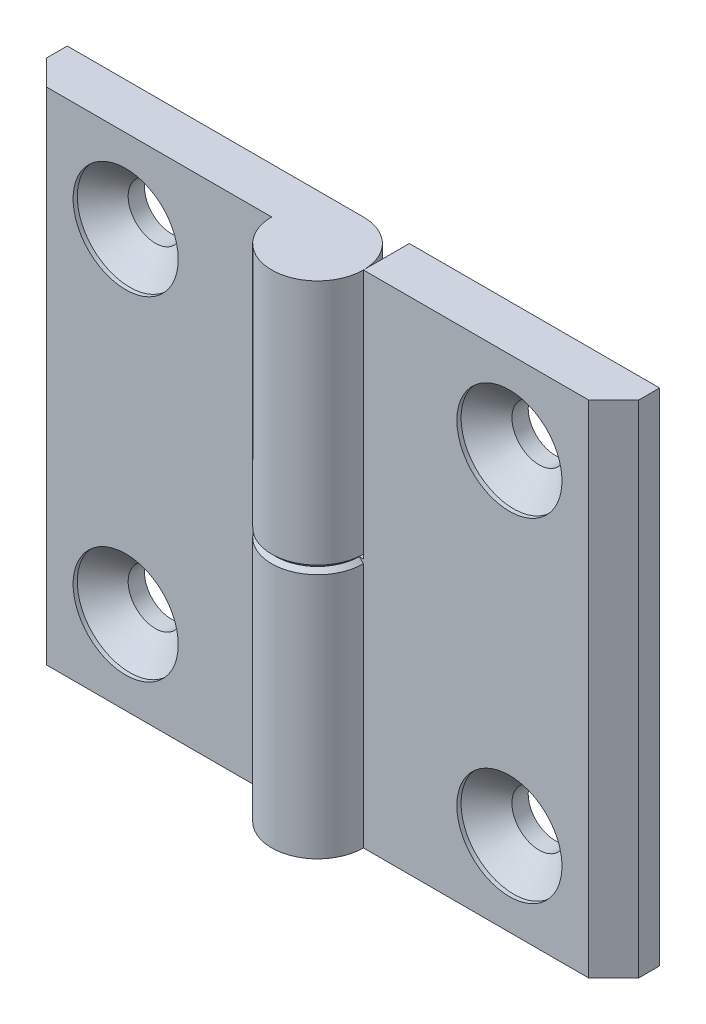
ISO-10303-21;
HEADER;
FILE_DESCRIPTION(('STEP AP214'),'2;1');
FILE_NAME('part.step','',(''),(''),'','','');
FILE_SCHEMA(('AUTOMOTIVE_DESIGN { 1 0 10303 214 1 1 1 1 }'));
ENDSEC;
DATA;
#1=APPLICATION_CONTEXT('core data for automotive mechanical design processes');
#2=APPLICATION_PROTOCOL_DEFINITION('international standard','automotive_design',2000,#1);
#3=PRODUCT_CONTEXT('',#1,'mechanical');
#4=PRODUCT('Part','Part','',(#3));
#5=PRODUCT_RELATED_PRODUCT_CATEGORY('part','',(#4));
#6=PRODUCT_DEFINITION_FORMATION('','',#4);
#7=PRODUCT_DEFINITION_CONTEXT('part definition',#1,'design');
#8=PRODUCT_DEFINITION('design','',#6,#7);
#9=PRODUCT_DEFINITION_SHAPE('','',#8);
#10=(LENGTH_UNIT() NAMED_UNIT(*) SI_UNIT(.MILLI.,.METRE.));
#11=(NAMED_UNIT(*) PLANE_ANGLE_UNIT() SI_UNIT($,.RADIAN.));
#12=(NAMED_UNIT(*) SI_UNIT($,.STERADIAN.) SOLID_ANGLE_UNIT());
#13=UNCERTAINTY_MEASURE_WITH_UNIT(LENGTH_MEASURE(1.E-05),#10,'distance_accuracy_value','');
#14=(GEOMETRIC_REPRESENTATION_CONTEXT(3) GLOBAL_UNCERTAINTY_ASSIGNED_CONTEXT((#13)) GLOBAL_UNIT_ASSIGNED_CONTEXT((#10,
#11,#12)) REPRESENTATION_CONTEXT('',''));
#15=CARTESIAN_POINT('',(0.,0.,0.));
#16=DIRECTION('',(0.,0.,1.));
#17=DIRECTION('',(1.,0.,0.));
#18=AXIS2_PLACEMENT_3D('',#15,#16,#17);
#19=CARTESIAN_POINT('',(0.,-30.,0.));
#20=DIRECTION('',(0.,1.,0.));
#21=DIRECTION('',(0.,0.,-1.));
#22=AXIS2_PLACEMENT_3D('',#19,#20,#21);
#23=CYLINDRICAL_SURFACE('',#22,5.5);
#24=DIRECTION('',(0.,1.,0.));
#25=VECTOR('',#24,1.);
#26=CARTESIAN_POINT('',(5.5,-30.,0.));
#27=LINE('',#26,#25);
#28=CARTESIAN_POINT('',(5.5,-30.,0.));
#29=VERTEX_POINT('',#28);
#30=CARTESIAN_POINT('',(5.5,-0.499999999999997,0.));
#31=VERTEX_POINT('',#30);
#32=EDGE_CURVE('E157',#29,#31,#27,.T.);
#33=ORIENTED_EDGE('',*,*,#32,.T.);
#34=CARTESIAN_POINT('',(0.,-0.499999999999997,0.));
#35=DIRECTION('',(0.,-1.,0.));
#36=DIRECTION('',(0.,0.,1.));
#37=AXIS2_PLACEMENT_3D('',#34,#35,#36);
#38=CIRCLE('',#37,5.5);
#39=CARTESIAN_POINT('',(0.,-0.499999999999997,-5.5));
#40=VERTEX_POINT('',#39);
#41=EDGE_CURVE('E175',#31,#40,#38,.T.);
#42=ORIENTED_EDGE('',*,*,#41,.T.);
#43=DIRECTION('',(0.,1.,0.));
#44=VECTOR('',#43,1.);
#45=CARTESIAN_POINT('',(0.,-30.,-5.5));
#46=LINE('',#45,#44);
#47=CARTESIAN_POINT('',(0.,-30.,-5.5));
#48=VERTEX_POINT('',#47);
#49=EDGE_CURVE('E167',#48,#40,#46,.T.);
#50=ORIENTED_EDGE('',*,*,#49,.F.);
#51=CARTESIAN_POINT('',(0.,-30.,0.));
#52=DIRECTION('',(0.,-1.,0.));
#53=DIRECTION('',(0.,0.,1.));
#54=AXIS2_PLACEMENT_3D('',#51,#52,#53);
#55=CIRCLE('',#54,5.5);
#56=EDGE_CURVE('E156',#29,#48,#55,.T.);
#57=ORIENTED_EDGE('',*,*,#56,.F.);
#58=EDGE_LOOP('',(#33,#42,#50,#57));
#59=FACE_BOUND('',#58,.T.);
#60=ADVANCED_FACE('F46',(#59),#23,.T.);
#61=CARTESIAN_POINT('',(0.,-30.,-5.5));
#62=DIRECTION('',(0.,0.,1.));
#63=DIRECTION('',(-1.,0.,0.));
#64=AXIS2_PLACEMENT_3D('',#61,#62,#63);
#65=PLANE('',#64);
#66=CARTESIAN_POINT('',(23.,-20.,-5.50000000000017));
#67=DIRECTION('',(0.,0.,1.));
#68=DIRECTION('',(-1.,0.,0.));
#69=AXIS2_PLACEMENT_3D('',#66,#67,#68);
#70=CIRCLE('',#69,3.25);
#71=CARTESIAN_POINT('',(19.75,-20.,-5.50000000000015));
#72=VERTEX_POINT('',#71);
#73=EDGE_CURVE('E197',#72,#72,#70,.T.);
#74=ORIENTED_EDGE('',*,*,#73,.T.);
#75=EDGE_LOOP('',(#74));
#76=FACE_BOUND('',#75,.T.);
#77=CARTESIAN_POINT('',(23.,20.,-5.50000000000017));
#78=DIRECTION('',(0.,0.,1.));
#79=DIRECTION('',(-1.,0.,0.));
#80=AXIS2_PLACEMENT_3D('',#77,#78,#79);
#81=CIRCLE('',#80,3.25);
#82=CARTESIAN_POINT('',(19.75,20.,-5.50000000000015));
#83=VERTEX_POINT('',#82);
#84=EDGE_CURVE('E139',#83,#83,#81,.T.);
#85=ORIENTED_EDGE('',*,*,#84,.T.);
#86=EDGE_LOOP('',(#85));
#87=FACE_BOUND('',#86,.T.);
#88=ORIENTED_EDGE('',*,*,#49,.T.);
#89=DIRECTION('',(1.,0.,0.));
#90=VECTOR('',#89,1.);
#91=CARTESIAN_POINT('',(0.,-0.499999999999997,-5.5));
#92=LINE('',#91,#90);
#93=CARTESIAN_POINT('',(5.49999999999996,-0.499999999999997,-5.50000000000004));
#94=VERTEX_POINT('',#93);
#95=EDGE_CURVE('E138',#40,#94,#92,.T.);
#96=ORIENTED_EDGE('',*,*,#95,.T.);
#97=DIRECTION('',(0.,1.,0.));
#98=VECTOR('',#97,1.);
#99=CARTESIAN_POINT('',(5.49999999999996,30.,-5.50000000000004));
#100=LINE('',#99,#98);
#101=CARTESIAN_POINT('',(5.49999999999996,30.,-5.50000000000004));
#102=VERTEX_POINT('',#101);
#103=EDGE_CURVE('E119',#94,#102,#100,.T.);
#104=ORIENTED_EDGE('',*,*,#103,.T.);
#105=DIRECTION('',(1.,0.,0.));
#106=VECTOR('',#105,1.);
#107=CARTESIAN_POINT('',(0.,30.,-5.5));
#108=LINE('',#107,#106);
#109=CARTESIAN_POINT('',(35.5,30.,-5.50000000000026));
#110=VERTEX_POINT('',#109);
#111=EDGE_CURVE('E135',#102,#110,#108,.T.);
#112=ORIENTED_EDGE('',*,*,#111,.T.);
#113=DIRECTION('',(0.,1.,0.));
#114=VECTOR('',#113,1.);
#115=CARTESIAN_POINT('',(35.5,-30.,-5.50000000000026));
#116=LINE('',#115,#114);
#117=CARTESIAN_POINT('',(35.5,-30.,-5.50000000000026));
#118=VERTEX_POINT('',#117);
#119=EDGE_CURVE('E165',#118,#110,#116,.T.);
#120=ORIENTED_EDGE('',*,*,#119,.F.);
#121=DIRECTION('',(1.,0.,0.));
#122=VECTOR('',#121,1.);
#123=CARTESIAN_POINT('',(0.,-30.,-5.5));
#124=LINE('',#123,#122);
#125=EDGE_CURVE('E213',#48,#118,#124,.T.);
#126=ORIENTED_EDGE('',*,*,#125,.F.);
#127=EDGE_LOOP('',(#88,#96,#104,#112,#120,#126));
#128=FACE_BOUND('',#127,.T.);
#129=ADVANCED_FACE('F133',(#76,#87,#128),#65,.F.);
#130=CARTESIAN_POINT('',(35.5,-30.,-5.50000000000026));
#131=DIRECTION('',(-1.,0.,0.));
#132=DIRECTION('',(0.,0.,-1.));
#133=AXIS2_PLACEMENT_3D('',#130,#131,#132);
#134=PLANE('',#133);
#135=DIRECTION('',(0.,0.,1.));
#136=VECTOR('',#135,1.);
#137=CARTESIAN_POINT('',(35.5,30.,-5.50000000000026));
#138=LINE('',#137,#136);
#139=CARTESIAN_POINT('',(35.5,30.,-3.00000000000026));
#140=VERTEX_POINT('',#139);
#141=EDGE_CURVE('E144',#110,#140,#138,.T.);
#142=ORIENTED_EDGE('',*,*,#141,.T.);
#143=DIRECTION('',(0.,1.,0.));
#144=VECTOR('',#143,1.);
#145=CARTESIAN_POINT('',(35.5,-30.,-3.00000000000026));
#146=LINE('',#145,#144);
#147=CARTESIAN_POINT('',(35.5,-30.,-3.00000000000026));
#148=VERTEX_POINT('',#147);
#149=EDGE_CURVE('E162',#148,#140,#146,.T.);
#150=ORIENTED_EDGE('',*,*,#149,.F.);
#151=DIRECTION('',(0.,0.,1.));
#152=VECTOR('',#151,1.);
#153=CARTESIAN_POINT('',(35.5,-30.,-5.50000000000026));
#154=LINE('',#153,#152);
#155=EDGE_CURVE('E215',#118,#148,#154,.T.);
#156=ORIENTED_EDGE('',*,*,#155,.F.);
#157=ORIENTED_EDGE('',*,*,#119,.T.);
#158=EDGE_LOOP('',(#142,#150,#156,#157));
#159=FACE_BOUND('',#158,.T.);
#160=ADVANCED_FACE('F229',(#159),#134,.F.);
#161=CARTESIAN_POINT('',(35.5,-30.,-3.00000000000026));
#162=DIRECTION('',(-0.707106781186549,0.,-0.707106781186546));
#163=DIRECTION('',(0.707106781186546,0.,-0.707106781186549));
#164=AXIS2_PLACEMENT_3D('',#161,#162,#163);
#165=PLANE('',#164);
#166=DIRECTION('',(-0.707106781186546,0.,0.707106781186549));
#167=VECTOR('',#166,1.);
#168=CARTESIAN_POINT('',(35.5,30.,-3.00000000000026));
#169=LINE('',#168,#167);
#170=CARTESIAN_POINT('',(32.5,30.,-2.42866695413719E-13));
#171=VERTEX_POINT('',#170);
#172=EDGE_CURVE('E146',#140,#171,#169,.T.);
#173=ORIENTED_EDGE('',*,*,#172,.T.);
#174=DIRECTION('',(0.,1.,0.));
#175=VECTOR('',#174,1.);
#176=CARTESIAN_POINT('',(32.5,-30.,-2.42866695413719E-13));
#177=LINE('',#176,#175);
#178=CARTESIAN_POINT('',(32.5,-30.,-2.42866695413719E-13));
#179=VERTEX_POINT('',#178);
#180=EDGE_CURVE('E159',#179,#171,#177,.T.);
#181=ORIENTED_EDGE('',*,*,#180,.F.);
#182=DIRECTION('',(-0.707106781186546,0.,0.707106781186549));
#183=VECTOR('',#182,1.);
#184=CARTESIAN_POINT('',(35.5,-30.,-3.00000000000026));
#185=LINE('',#184,#183);
#186=EDGE_CURVE('E216',#148,#179,#185,.T.);
#187=ORIENTED_EDGE('',*,*,#186,.F.);
#188=ORIENTED_EDGE('',*,*,#149,.T.);
#189=EDGE_LOOP('',(#173,#181,#187,#188));
#190=FACE_BOUND('',#189,.T.);
#191=ADVANCED_FACE('F231',(#190),#165,.F.);
#192=CARTESIAN_POINT('',(32.5,-30.,-2.42866695413719E-13));
#193=DIRECTION('',(0.,0.,-1.));
#194=DIRECTION('',(1.,0.,0.));
#195=AXIS2_PLACEMENT_3D('',#192,#193,#194);
#196=PLANE('',#195);
#197=CARTESIAN_POINT('',(23.,-20.,-1.72091732573437E-13));
#198=DIRECTION('',(0.,0.,1.));
#199=DIRECTION('',(-1.,0.,0.));
#200=AXIS2_PLACEMENT_3D('',#197,#198,#199);
#201=CIRCLE('',#200,6.3);
#202=CARTESIAN_POINT('',(16.7,-20.,-1.25012957770162E-13));
#203=VERTEX_POINT('',#202);
#204=EDGE_CURVE('E185',#203,#203,#201,.T.);
#205=ORIENTED_EDGE('',*,*,#204,.F.);
#206=EDGE_LOOP('',(#205));
#207=FACE_BOUND('',#206,.T.);
#208=CARTESIAN_POINT('',(23.,20.,-1.72091732573437E-13));
#209=DIRECTION('',(0.,0.,1.));
#210=DIRECTION('',(-1.,0.,0.));
#211=AXIS2_PLACEMENT_3D('',#208,#209,#210);
#212=CIRCLE('',#211,6.3);
#213=CARTESIAN_POINT('',(16.7,20.,-1.25012957770162E-13));
#214=VERTEX_POINT('',#213);
#215=EDGE_CURVE('E200',#214,#214,#212,.T.);
#216=ORIENTED_EDGE('',*,*,#215,.F.);
#217=EDGE_LOOP('',(#216));
#218=FACE_BOUND('',#217,.T.);
#219=DIRECTION('',(-1.,0.,0.));
#220=VECTOR('',#219,1.);
#221=CARTESIAN_POINT('',(32.5,30.,-2.42866695413719E-13));
#222=LINE('',#221,#220);
#223=CARTESIAN_POINT('',(5.5,30.,0.));
#224=VERTEX_POINT('',#223);
#225=EDGE_CURVE('E154',#171,#224,#222,.T.);
#226=ORIENTED_EDGE('',*,*,#225,.T.);
#227=DIRECTION('',(0.,-1.,0.));
#228=VECTOR('',#227,1.);
#229=CARTESIAN_POINT('',(5.5,-30.,0.));
#230=LINE('',#229,#228);
#231=CARTESIAN_POINT('',(5.5,0.,0.));
#232=VERTEX_POINT('',#231);
#233=EDGE_CURVE('E123',#224,#232,#230,.T.);
#234=ORIENTED_EDGE('',*,*,#233,.T.);
#235=DIRECTION('',(1.,0.,0.));
#236=VECTOR('',#235,1.);
#237=CARTESIAN_POINT('',(-5.5,0.,0.));
#238=LINE('',#237,#236);
#239=CARTESIAN_POINT('',(4.99999999999999,0.,0.));
#240=VERTEX_POINT('',#239);
#241=EDGE_CURVE('E170',#240,#232,#238,.T.);
#242=ORIENTED_EDGE('',*,*,#241,.F.);
#243=DIRECTION('',(0.707106781186555,-0.70710678118654,0.));
#244=VECTOR('',#243,1.);
#245=CARTESIAN_POINT('',(0.,4.99999999999989,0.));
#246=LINE('',#245,#244);
#247=EDGE_CURVE('E12',#240,#31,#246,.T.);
#248=ORIENTED_EDGE('',*,*,#247,.T.);
#249=ORIENTED_EDGE('',*,*,#32,.F.);
#250=DIRECTION('',(-1.,0.,0.));
#251=VECTOR('',#250,1.);
#252=CARTESIAN_POINT('',(32.5,-30.,-2.42866695413719E-13));
#253=LINE('',#252,#251);
#254=EDGE_CURVE('E150',#179,#29,#253,.T.);
#255=ORIENTED_EDGE('',*,*,#254,.F.);
#256=ORIENTED_EDGE('',*,*,#180,.T.);
#257=EDGE_LOOP('',(#226,#234,#242,#248,#249,#255,#256));
#258=FACE_BOUND('',#257,.T.);
#259=ADVANCED_FACE('F224',(#207,#218,#258),#196,.F.);
#260=CARTESIAN_POINT('',(0.,-30.,0.));
#261=DIRECTION('',(0.,-1.,0.));
#262=DIRECTION('',(0.,0.,1.));
#263=AXIS2_PLACEMENT_3D('',#260,#261,#262);
#264=PLANE('',#263);
#265=ORIENTED_EDGE('',*,*,#56,.T.);
#266=ORIENTED_EDGE('',*,*,#125,.T.);
#267=ORIENTED_EDGE('',*,*,#155,.T.);
#268=ORIENTED_EDGE('',*,*,#186,.T.);
#269=ORIENTED_EDGE('',*,*,#254,.T.);
#270=EDGE_LOOP('',(#265,#266,#267,#268,#269));
#271=FACE_BOUND('',#270,.T.);
#272=ADVANCED_FACE('F221',(#271),#264,.T.);
#273=CARTESIAN_POINT('',(0.,30.,0.));
#274=DIRECTION('',(0.,-1.,0.));
#275=DIRECTION('',(0.,0.,1.));
#276=AXIS2_PLACEMENT_3D('',#273,#274,#275);
#277=PLANE('',#276);
#278=ORIENTED_EDGE('',*,*,#111,.F.);
#279=DIRECTION('',(0.,0.,1.));
#280=VECTOR('',#279,1.);
#281=CARTESIAN_POINT('',(5.49999999999996,30.,-5.50000000000004));
#282=LINE('',#281,#280);
#283=EDGE_CURVE('E116',#102,#224,#282,.T.);
#284=ORIENTED_EDGE('',*,*,#283,.T.);
#285=ORIENTED_EDGE('',*,*,#225,.F.);
#286=ORIENTED_EDGE('',*,*,#172,.F.);
#287=ORIENTED_EDGE('',*,*,#141,.F.);
#288=EDGE_LOOP('',(#278,#284,#285,#286,#287));
#289=FACE_BOUND('',#288,.T.);
#290=ADVANCED_FACE('F142',(#289),#277,.F.);
#291=CARTESIAN_POINT('',(-5.50000000000004,0.,-5.49999999999996));
#292=DIRECTION('',(0.,-1.,0.));
#293=DIRECTION('',(0.,0.,1.));
#294=AXIS2_PLACEMENT_3D('',#291,#292,#293);
#295=PLANE('',#294);
#296=DIRECTION('',(0.,0.,1.));
#297=VECTOR('',#296,1.);
#298=CARTESIAN_POINT('',(5.49999999999996,0.,-5.50000000000004));
#299=LINE('',#298,#297);
#300=CARTESIAN_POINT('',(5.49999999999996,0.,-5.00000000000003));
#301=VERTEX_POINT('',#300);
#302=EDGE_CURVE('E128',#301,#232,#299,.T.);
#303=ORIENTED_EDGE('',*,*,#302,.F.);
#304=DIRECTION('',(-1.,0.,0.));
#305=VECTOR('',#304,1.);
#306=CARTESIAN_POINT('',(-5.50000000000004,0.,-4.99999999999995));
#307=LINE('',#306,#305);
#308=CARTESIAN_POINT('',(0.,0.,-4.99999999999999));
#309=VERTEX_POINT('',#308);
#310=EDGE_CURVE('E69',#301,#309,#307,.T.);
#311=ORIENTED_EDGE('',*,*,#310,.T.);
#312=CARTESIAN_POINT('',(0.,0.,0.));
#313=DIRECTION('',(0.,-1.,0.));
#314=DIRECTION('',(0.,0.,1.));
#315=AXIS2_PLACEMENT_3D('',#312,#313,#314);
#316=CIRCLE('',#315,4.99999999999999);
#317=EDGE_CURVE('E172',#309,#240,#316,.F.);
#318=ORIENTED_EDGE('',*,*,#317,.T.);
#319=ORIENTED_EDGE('',*,*,#241,.T.);
#320=EDGE_LOOP('',(#303,#311,#318,#319));
#321=FACE_BOUND('',#320,.T.);
#322=ADVANCED_FACE('F178',(#321),#295,.F.);
#323=CARTESIAN_POINT('',(5.49999999999996,30.,-5.50000000000004));
#324=DIRECTION('',(1.,0.,0.));
#325=DIRECTION('',(0.,0.,1.));
#326=AXIS2_PLACEMENT_3D('',#323,#324,#325);
#327=PLANE('',#326);
#328=ORIENTED_EDGE('',*,*,#283,.F.);
#329=ORIENTED_EDGE('',*,*,#103,.F.);
#330=DIRECTION('',(0.,-0.70710678118654,-0.707106781186555));
#331=VECTOR('',#330,1.);
#332=CARTESIAN_POINT('',(5.50000000000007,14.7499999999997,9.74999999999996));
#333=LINE('',#332,#331);
#334=EDGE_CURVE('E56',#94,#301,#333,.F.);
#335=ORIENTED_EDGE('',*,*,#334,.T.);
#336=ORIENTED_EDGE('',*,*,#302,.T.);
#337=ORIENTED_EDGE('',*,*,#233,.F.);
#338=EDGE_LOOP('',(#328,#329,#335,#336,#337));
#339=FACE_BOUND('',#338,.T.);
#340=ADVANCED_FACE('F118',(#339),#327,.F.);
#341=CARTESIAN_POINT('',(23.,20.,-1.7187489213894E-13));
#342=DIRECTION('',(0.,0.,1.));
#343=DIRECTION('',(-1.,0.,0.));
#344=AXIS2_PLACEMENT_3D('',#341,#342,#343);
#345=CYLINDRICAL_SURFACE('',#344,3.25);
#346=ORIENTED_EDGE('',*,*,#84,.F.);
#347=EDGE_LOOP('',(#346));
#348=FACE_BOUND('',#347,.T.);
#349=CARTESIAN_POINT('',(23.,20.,-3.55000000000017));
#350=DIRECTION('',(0.,0.,1.));
#351=DIRECTION('',(-1.,0.,0.));
#352=AXIS2_PLACEMENT_3D('',#349,#350,#351);
#353=CIRCLE('',#352,3.25);
#354=CARTESIAN_POINT('',(19.75,20.,-3.55000000000015));
#355=VERTEX_POINT('',#354);
#356=EDGE_CURVE('E206',#355,#355,#353,.T.);
#357=ORIENTED_EDGE('',*,*,#356,.T.);
#358=EDGE_LOOP('',(#357));
#359=FACE_BOUND('',#358,.T.);
#360=ADVANCED_FACE('F269',(#348,#359),#345,.F.);
#361=CARTESIAN_POINT('',(23.,20.,-0.500000000000172));
#362=DIRECTION('',(0.,0.,1.));
#363=DIRECTION('',(-1.,0.,0.));
#364=AXIS2_PLACEMENT_3D('',#361,#362,#363);
#365=CONICAL_SURFACE('',#364,6.3,0.785398163397449);
#366=ORIENTED_EDGE('',*,*,#356,.F.);
#367=EDGE_LOOP('',(#366));
#368=FACE_BOUND('',#367,.T.);
#369=CARTESIAN_POINT('',(23.,20.,-0.500000000000172));
#370=DIRECTION('',(0.,0.,1.));
#371=DIRECTION('',(-1.,0.,0.));
#372=AXIS2_PLACEMENT_3D('',#369,#370,#371);
#373=CIRCLE('',#372,6.3);
#374=CARTESIAN_POINT('',(16.7,20.,-0.500000000000125));
#375=VERTEX_POINT('',#374);
#376=EDGE_CURVE('E203',#375,#375,#373,.T.);
#377=ORIENTED_EDGE('',*,*,#376,.T.);
#378=EDGE_LOOP('',(#377));
#379=FACE_BOUND('',#378,.T.);
#380=ADVANCED_FACE('F272',(#368,#379),#365,.F.);
#381=CARTESIAN_POINT('',(23.,20.,-1.7187489213894E-13));
#382=DIRECTION('',(0.,0.,1.));
#383=DIRECTION('',(-1.,0.,0.));
#384=AXIS2_PLACEMENT_3D('',#381,#382,#383);
#385=CYLINDRICAL_SURFACE('',#384,6.3);
#386=ORIENTED_EDGE('',*,*,#376,.F.);
#387=EDGE_LOOP('',(#386));
#388=FACE_BOUND('',#387,.T.);
#389=ORIENTED_EDGE('',*,*,#215,.T.);
#390=EDGE_LOOP('',(#389));
#391=FACE_BOUND('',#390,.T.);
#392=ADVANCED_FACE('F276',(#388,#391),#385,.F.);
#393=CARTESIAN_POINT('',(23.,-20.,-1.7187489213894E-13));
#394=DIRECTION('',(0.,0.,1.));
#395=DIRECTION('',(-1.,0.,0.));
#396=AXIS2_PLACEMENT_3D('',#393,#394,#395);
#397=CYLINDRICAL_SURFACE('',#396,3.25);
#398=ORIENTED_EDGE('',*,*,#73,.F.);
#399=EDGE_LOOP('',(#398));
#400=FACE_BOUND('',#399,.T.);
#401=CARTESIAN_POINT('',(23.,-20.,-3.55000000000017));
#402=DIRECTION('',(0.,0.,1.));
#403=DIRECTION('',(-1.,0.,0.));
#404=AXIS2_PLACEMENT_3D('',#401,#402,#403);
#405=CIRCLE('',#404,3.25);
#406=CARTESIAN_POINT('',(19.75,-20.,-3.55000000000015));
#407=VERTEX_POINT('',#406);
#408=EDGE_CURVE('E192',#407,#407,#405,.T.);
#409=ORIENTED_EDGE('',*,*,#408,.T.);
#410=EDGE_LOOP('',(#409));
#411=FACE_BOUND('',#410,.T.);
#412=ADVANCED_FACE('F280',(#400,#411),#397,.F.);
#413=CARTESIAN_POINT('',(23.,-20.,-0.500000000000172));
#414=DIRECTION('',(0.,0.,1.));
#415=DIRECTION('',(-1.,0.,0.));
#416=AXIS2_PLACEMENT_3D('',#413,#414,#415);
#417=CONICAL_SURFACE('',#416,6.3,0.785398163397449);
#418=ORIENTED_EDGE('',*,*,#408,.F.);
#419=EDGE_LOOP('',(#418));
#420=FACE_BOUND('',#419,.T.);
#421=CARTESIAN_POINT('',(23.,-20.,-0.500000000000172));
#422=DIRECTION('',(0.,0.,1.));
#423=DIRECTION('',(-1.,0.,0.));
#424=AXIS2_PLACEMENT_3D('',#421,#422,#423);
#425=CIRCLE('',#424,6.3);
#426=CARTESIAN_POINT('',(16.7,-20.,-0.500000000000125));
#427=VERTEX_POINT('',#426);
#428=EDGE_CURVE('E187',#427,#427,#425,.T.);
#429=ORIENTED_EDGE('',*,*,#428,.T.);
#430=EDGE_LOOP('',(#429));
#431=FACE_BOUND('',#430,.T.);
#432=ADVANCED_FACE('F238',(#420,#431),#417,.F.);
#433=CARTESIAN_POINT('',(23.,-20.,-1.7187489213894E-13));
#434=DIRECTION('',(0.,0.,1.));
#435=DIRECTION('',(-1.,0.,0.));
#436=AXIS2_PLACEMENT_3D('',#433,#434,#435);
#437=CYLINDRICAL_SURFACE('',#436,6.3);
#438=ORIENTED_EDGE('',*,*,#428,.F.);
#439=EDGE_LOOP('',(#438));
#440=FACE_BOUND('',#439,.T.);
#441=ORIENTED_EDGE('',*,*,#204,.T.);
#442=EDGE_LOOP('',(#441));
#443=FACE_BOUND('',#442,.T.);
#444=ADVANCED_FACE('F233',(#440,#443),#437,.F.);
#445=CARTESIAN_POINT('',(0.,-0.499999999999997,0.));
#446=DIRECTION('',(0.,-1.,0.));
#447=DIRECTION('',(0.,0.,1.));
#448=AXIS2_PLACEMENT_3D('',#445,#446,#447);
#449=CONICAL_SURFACE('',#448,5.5,0.785398163397459);
#450=ORIENTED_EDGE('',*,*,#247,.F.);
#451=ORIENTED_EDGE('',*,*,#317,.F.);
#452=DIRECTION('',(0.,0.70710678118654,0.707106781186555));
#453=VECTOR('',#452,1.);
#454=CARTESIAN_POINT('',(0.,-0.499999999999997,-5.5));
#455=LINE('',#454,#453);
#456=EDGE_CURVE('E51',#40,#309,#455,.T.);
#457=ORIENTED_EDGE('',*,*,#456,.F.);
#458=ORIENTED_EDGE('',*,*,#41,.F.);
#459=EDGE_LOOP('',(#450,#451,#457,#458));
#460=FACE_BOUND('',#459,.T.);
#461=ADVANCED_FACE('F49',(#460),#449,.T.);
#462=CARTESIAN_POINT('',(0.,-0.499999999999997,-5.5));
#463=DIRECTION('',(0.,-0.707106781186555,0.70710678118654));
#464=DIRECTION('',(1.,0.,0.));
#465=AXIS2_PLACEMENT_3D('',#462,#463,#464);
#466=PLANE('',#465);
#467=ORIENTED_EDGE('',*,*,#456,.T.);
#468=ORIENTED_EDGE('',*,*,#310,.F.);
#469=ORIENTED_EDGE('',*,*,#334,.F.);
#470=ORIENTED_EDGE('',*,*,#95,.F.);
#471=EDGE_LOOP('',(#467,#468,#469,#470));
#472=FACE_BOUND('',#471,.T.);
#473=ADVANCED_FACE('F181',(#472),#466,.F.);
#474=CLOSED_SHELL('',(#60,#129,#160,#191,#259,#272,#290,#322,#340,#360,#380,#392,#412,#432,#444,
#461,#473));
#475=MANIFOLD_SOLID_BREP('B2',#474);
#476=CARTESIAN_POINT('',(0.,30.,0.));
#477=DIRECTION('',(0.,-1.,0.));
#478=DIRECTION('',(0.,0.,-1.));
#479=AXIS2_PLACEMENT_3D('',#476,#477,#478);
#480=CYLINDRICAL_SURFACE('',#479,5.5);
#481=DIRECTION('',(0.,-1.,0.));
#482=VECTOR('',#481,1.);
#483=CARTESIAN_POINT('',(-5.5,30.,0.));
#484=LINE('',#483,#482);
#485=CARTESIAN_POINT('',(-5.5,30.,0.));
#486=VERTEX_POINT('',#485);
#487=CARTESIAN_POINT('',(-5.5,0.499999999999997,0.));
#488=VERTEX_POINT('',#487);
#489=EDGE_CURVE('E512',#486,#488,#484,.T.);
#490=ORIENTED_EDGE('',*,*,#489,.T.);
#491=CARTESIAN_POINT('',(0.,0.499999999999997,0.));
#492=DIRECTION('',(0.,1.,0.));
#493=DIRECTION('',(0.,0.,1.));
#494=AXIS2_PLACEMENT_3D('',#491,#492,#493);
#495=CIRCLE('',#494,5.5);
#496=CARTESIAN_POINT('',(0.,0.499999999999997,-5.5));
#497=VERTEX_POINT('',#496);
#498=EDGE_CURVE('E530',#488,#497,#495,.T.);
#499=ORIENTED_EDGE('',*,*,#498,.T.);
#500=DIRECTION('',(0.,-1.,0.));
#501=VECTOR('',#500,1.);
#502=CARTESIAN_POINT('',(0.,30.,-5.5));
#503=LINE('',#502,#501);
#504=CARTESIAN_POINT('',(0.,30.,-5.5));
#505=VERTEX_POINT('',#504);
#506=EDGE_CURVE('E522',#505,#497,#503,.T.);
#507=ORIENTED_EDGE('',*,*,#506,.F.);
#508=CARTESIAN_POINT('',(0.,30.,0.));
#509=DIRECTION('',(0.,1.,0.));
#510=DIRECTION('',(0.,0.,1.));
#511=AXIS2_PLACEMENT_3D('',#508,#509,#510);
#512=CIRCLE('',#511,5.5);
#513=EDGE_CURVE('E511',#486,#505,#512,.T.);
#514=ORIENTED_EDGE('',*,*,#513,.F.);
#515=EDGE_LOOP('',(#490,#499,#507,#514));
#516=FACE_BOUND('',#515,.T.);
#517=ADVANCED_FACE('F401',(#516),#480,.T.);
#518=CARTESIAN_POINT('',(0.,30.,-5.5));
#519=DIRECTION('',(0.,0.,1.));
#520=DIRECTION('',(1.,0.,0.));
#521=AXIS2_PLACEMENT_3D('',#518,#519,#520);
#522=PLANE('',#521);
#523=CARTESIAN_POINT('',(-23.,20.,-5.5));
#524=DIRECTION('',(0.,0.,1.));
#525=DIRECTION('',(1.,0.,0.));
#526=AXIS2_PLACEMENT_3D('',#523,#524,#525);
#527=CIRCLE('',#526,3.25);
#528=CARTESIAN_POINT('',(-19.75,20.,-5.5));
#529=VERTEX_POINT('',#528);
#530=EDGE_CURVE('E552',#529,#529,#527,.T.);
#531=ORIENTED_EDGE('',*,*,#530,.T.);
#532=EDGE_LOOP('',(#531));
#533=FACE_BOUND('',#532,.T.);
#534=CARTESIAN_POINT('',(-23.,-20.,-5.5));
#535=DIRECTION('',(0.,0.,1.));
#536=DIRECTION('',(1.,0.,0.));
#537=AXIS2_PLACEMENT_3D('',#534,#535,#536);
#538=CIRCLE('',#537,3.25);
#539=CARTESIAN_POINT('',(-19.75,-20.,-5.5));
#540=VERTEX_POINT('',#539);
#541=EDGE_CURVE('E494',#540,#540,#538,.T.);
#542=ORIENTED_EDGE('',*,*,#541,.T.);
#543=EDGE_LOOP('',(#542));
#544=FACE_BOUND('',#543,.T.);
#545=ORIENTED_EDGE('',*,*,#506,.T.);
#546=DIRECTION('',(-1.,0.,0.));
#547=VECTOR('',#546,1.);
#548=CARTESIAN_POINT('',(0.,0.499999999999997,-5.5));
#549=LINE('',#548,#547);
#550=CARTESIAN_POINT('',(-5.5,0.499999999999997,-5.5));
#551=VERTEX_POINT('',#550);
#552=EDGE_CURVE('E493',#497,#551,#549,.T.);
#553=ORIENTED_EDGE('',*,*,#552,.T.);
#554=DIRECTION('',(0.,-1.,0.));
#555=VECTOR('',#554,1.);
#556=CARTESIAN_POINT('',(-5.5,-30.,-5.5));
#557=LINE('',#556,#555);
#558=CARTESIAN_POINT('',(-5.5,-30.,-5.5));
#559=VERTEX_POINT('',#558);
#560=EDGE_CURVE('E474',#551,#559,#557,.T.);
#561=ORIENTED_EDGE('',*,*,#560,.T.);
#562=DIRECTION('',(-1.,0.,0.));
#563=VECTOR('',#562,1.);
#564=CARTESIAN_POINT('',(0.,-30.,-5.5));
#565=LINE('',#564,#563);
#566=CARTESIAN_POINT('',(-35.5,-30.,-5.5));
#567=VERTEX_POINT('',#566);
#568=EDGE_CURVE('E490',#559,#567,#565,.T.);
#569=ORIENTED_EDGE('',*,*,#568,.T.);
#570=DIRECTION('',(0.,-1.,0.));
#571=VECTOR('',#570,1.);
#572=CARTESIAN_POINT('',(-35.5,30.,-5.5));
#573=LINE('',#572,#571);
#574=CARTESIAN_POINT('',(-35.5,30.,-5.5));
#575=VERTEX_POINT('',#574);
#576=EDGE_CURVE('E520',#575,#567,#573,.T.);
#577=ORIENTED_EDGE('',*,*,#576,.F.);
#578=DIRECTION('',(-1.,0.,0.));
#579=VECTOR('',#578,1.);
#580=CARTESIAN_POINT('',(0.,30.,-5.5));
#581=LINE('',#580,#579);
#582=EDGE_CURVE('E568',#505,#575,#581,.T.);
#583=ORIENTED_EDGE('',*,*,#582,.F.);
#584=EDGE_LOOP('',(#545,#553,#561,#569,#577,#583));
#585=FACE_BOUND('',#584,.T.);
#586=ADVANCED_FACE('F488',(#533,#544,#585),#522,.F.);
#587=CARTESIAN_POINT('',(-35.5,30.,-5.5));
#588=DIRECTION('',(1.,0.,0.));
#589=DIRECTION('',(0.,0.,-1.));
#590=AXIS2_PLACEMENT_3D('',#587,#588,#589);
#591=PLANE('',#590);
#592=DIRECTION('',(0.,0.,1.));
#593=VECTOR('',#592,1.);
#594=CARTESIAN_POINT('',(-35.5,-30.,-5.5));
#595=LINE('',#594,#593);
#596=CARTESIAN_POINT('',(-35.5,-30.,-3.));
#597=VERTEX_POINT('',#596);
#598=EDGE_CURVE('E499',#567,#597,#595,.T.);
#599=ORIENTED_EDGE('',*,*,#598,.T.);
#600=DIRECTION('',(0.,-1.,0.));
#601=VECTOR('',#600,1.);
#602=CARTESIAN_POINT('',(-35.5,30.,-3.));
#603=LINE('',#602,#601);
#604=CARTESIAN_POINT('',(-35.5,30.,-3.));
#605=VERTEX_POINT('',#604);
#606=EDGE_CURVE('E517',#605,#597,#603,.T.);
#607=ORIENTED_EDGE('',*,*,#606,.F.);
#608=DIRECTION('',(0.,0.,1.));
#609=VECTOR('',#608,1.);
#610=CARTESIAN_POINT('',(-35.5,30.,-5.5));
#611=LINE('',#610,#609);
#612=EDGE_CURVE('E570',#575,#605,#611,.T.);
#613=ORIENTED_EDGE('',*,*,#612,.F.);
#614=ORIENTED_EDGE('',*,*,#576,.T.);
#615=EDGE_LOOP('',(#599,#607,#613,#614));
#616=FACE_BOUND('',#615,.T.);
#617=ADVANCED_FACE('F584',(#616),#591,.F.);
#618=CARTESIAN_POINT('',(-35.5,30.,-3.));
#619=DIRECTION('',(0.707106781186543,0.,-0.707106781186552));
#620=DIRECTION('',(-0.707106781186552,0.,-0.707106781186543));
#621=AXIS2_PLACEMENT_3D('',#618,#619,#620);
#622=PLANE('',#621);
#623=DIRECTION('',(0.707106781186552,0.,0.707106781186543));
#624=VECTOR('',#623,1.);
#625=CARTESIAN_POINT('',(-35.5,-30.,-3.));
#626=LINE('',#625,#624);
#627=CARTESIAN_POINT('',(-32.5,-30.,0.));
#628=VERTEX_POINT('',#627);
#629=EDGE_CURVE('E501',#597,#628,#626,.T.);
#630=ORIENTED_EDGE('',*,*,#629,.T.);
#631=DIRECTION('',(0.,-1.,0.));
#632=VECTOR('',#631,1.);
#633=CARTESIAN_POINT('',(-32.5,30.,0.));
#634=LINE('',#633,#632);
#635=CARTESIAN_POINT('',(-32.5,30.,0.));
#636=VERTEX_POINT('',#635);
#637=EDGE_CURVE('E514',#636,#628,#634,.T.);
#638=ORIENTED_EDGE('',*,*,#637,.F.);
#639=DIRECTION('',(0.707106781186552,0.,0.707106781186543));
#640=VECTOR('',#639,1.);
#641=CARTESIAN_POINT('',(-35.5,30.,-3.));
#642=LINE('',#641,#640);
#643=EDGE_CURVE('E571',#605,#636,#642,.T.);
#644=ORIENTED_EDGE('',*,*,#643,.F.);
#645=ORIENTED_EDGE('',*,*,#606,.T.);
#646=EDGE_LOOP('',(#630,#638,#644,#645));
#647=FACE_BOUND('',#646,.T.);
#648=ADVANCED_FACE('F586',(#647),#622,.F.);
#649=CARTESIAN_POINT('',(-32.5,30.,0.));
#650=DIRECTION('',(0.,0.,-1.));
#651=DIRECTION('',(-1.,0.,0.));
#652=AXIS2_PLACEMENT_3D('',#649,#650,#651);
#653=PLANE('',#652);
#654=CARTESIAN_POINT('',(-23.,20.,0.));
#655=DIRECTION('',(0.,0.,1.));
#656=DIRECTION('',(1.,0.,0.));
#657=AXIS2_PLACEMENT_3D('',#654,#655,#656);
#658=CIRCLE('',#657,6.3);
#659=CARTESIAN_POINT('',(-16.7,20.,0.));
#660=VERTEX_POINT('',#659);
#661=EDGE_CURVE('E540',#660,#660,#658,.T.);
#662=ORIENTED_EDGE('',*,*,#661,.F.);
#663=EDGE_LOOP('',(#662));
#664=FACE_BOUND('',#663,.T.);
#665=CARTESIAN_POINT('',(-23.,-20.,0.));
#666=DIRECTION('',(0.,0.,1.));
#667=DIRECTION('',(1.,0.,0.));
#668=AXIS2_PLACEMENT_3D('',#665,#666,#667);
#669=CIRCLE('',#668,6.3);
#670=CARTESIAN_POINT('',(-16.7,-20.,0.));
#671=VERTEX_POINT('',#670);
#672=EDGE_CURVE('E555',#671,#671,#669,.T.);
#673=ORIENTED_EDGE('',*,*,#672,.F.);
#674=EDGE_LOOP('',(#673));
#675=FACE_BOUND('',#674,.T.);
#676=DIRECTION('',(1.,0.,0.));
#677=VECTOR('',#676,1.);
#678=CARTESIAN_POINT('',(-32.5,-30.,0.));
#679=LINE('',#678,#677);
#680=CARTESIAN_POINT('',(-5.5,-30.,0.));
#681=VERTEX_POINT('',#680);
#682=EDGE_CURVE('E509',#628,#681,#679,.T.);
#683=ORIENTED_EDGE('',*,*,#682,.T.);
#684=DIRECTION('',(0.,1.,0.));
#685=VECTOR('',#684,1.);
#686=CARTESIAN_POINT('',(-5.5,30.,0.));
#687=LINE('',#686,#685);
#688=CARTESIAN_POINT('',(-5.5,0.,0.));
#689=VERTEX_POINT('',#688);
#690=EDGE_CURVE('E478',#681,#689,#687,.T.);
#691=ORIENTED_EDGE('',*,*,#690,.T.);
#692=DIRECTION('',(-1.,0.,0.));
#693=VECTOR('',#692,1.);
#694=CARTESIAN_POINT('',(5.5,0.,0.));
#695=LINE('',#694,#693);
#696=CARTESIAN_POINT('',(-4.99999999999999,0.,0.));
#697=VERTEX_POINT('',#696);
#698=EDGE_CURVE('E525',#697,#689,#695,.T.);
#699=ORIENTED_EDGE('',*,*,#698,.F.);
#700=DIRECTION('',(-0.707106781186555,0.70710678118654,0.));
#701=VECTOR('',#700,1.);
#702=CARTESIAN_POINT('',(0.,-4.99999999999989,0.));
#703=LINE('',#702,#701);
#704=EDGE_CURVE('E44',#697,#488,#703,.T.);
#705=ORIENTED_EDGE('',*,*,#704,.T.);
#706=ORIENTED_EDGE('',*,*,#489,.F.);
#707=DIRECTION('',(1.,0.,0.));
#708=VECTOR('',#707,1.);
#709=CARTESIAN_POINT('',(-32.5,30.,0.));
#710=LINE('',#709,#708);
#711=EDGE_CURVE('E505',#636,#486,#710,.T.);
#712=ORIENTED_EDGE('',*,*,#711,.F.);
#713=ORIENTED_EDGE('',*,*,#637,.T.);
#714=EDGE_LOOP('',(#683,#691,#699,#705,#706,#712,#713));
#715=FACE_BOUND('',#714,.T.);
#716=ADVANCED_FACE('F579',(#664,#675,#715),#653,.F.);
#717=CARTESIAN_POINT('',(0.,30.,0.));
#718=DIRECTION('',(0.,1.,0.));
#719=DIRECTION('',(0.,0.,1.));
#720=AXIS2_PLACEMENT_3D('',#717,#718,#719);
#721=PLANE('',#720);
#722=ORIENTED_EDGE('',*,*,#513,.T.);
#723=ORIENTED_EDGE('',*,*,#582,.T.);
#724=ORIENTED_EDGE('',*,*,#612,.T.);
#725=ORIENTED_EDGE('',*,*,#643,.T.);
#726=ORIENTED_EDGE('',*,*,#711,.T.);
#727=EDGE_LOOP('',(#722,#723,#724,#725,#726));
#728=FACE_BOUND('',#727,.T.);
#729=ADVANCED_FACE('F576',(#728),#721,.T.);
#730=CARTESIAN_POINT('',(0.,-30.,0.));
#731=DIRECTION('',(0.,1.,0.));
#732=DIRECTION('',(0.,0.,1.));
#733=AXIS2_PLACEMENT_3D('',#730,#731,#732);
#734=PLANE('',#733);
#735=ORIENTED_EDGE('',*,*,#568,.F.);
#736=DIRECTION('',(0.,0.,1.));
#737=VECTOR('',#736,1.);
#738=CARTESIAN_POINT('',(-5.5,-30.,-5.5));
#739=LINE('',#738,#737);
#740=EDGE_CURVE('E471',#559,#681,#739,.T.);
#741=ORIENTED_EDGE('',*,*,#740,.T.);
#742=ORIENTED_EDGE('',*,*,#682,.F.);
#743=ORIENTED_EDGE('',*,*,#629,.F.);
#744=ORIENTED_EDGE('',*,*,#598,.F.);
#745=EDGE_LOOP('',(#735,#741,#742,#743,#744));
#746=FACE_BOUND('',#745,.T.);
#747=ADVANCED_FACE('F497',(#746),#734,.F.);
#748=CARTESIAN_POINT('',(5.5,0.,-5.5));
#749=DIRECTION('',(0.,1.,0.));
#750=DIRECTION('',(0.,0.,1.));
#751=AXIS2_PLACEMENT_3D('',#748,#749,#750);
#752=PLANE('',#751);
#753=DIRECTION('',(0.,0.,1.));
#754=VECTOR('',#753,1.);
#755=CARTESIAN_POINT('',(-5.5,0.,-5.5));
#756=LINE('',#755,#754);
#757=CARTESIAN_POINT('',(-5.5,0.,-4.99999999999999));
#758=VERTEX_POINT('',#757);
#759=EDGE_CURVE('E483',#758,#689,#756,.T.);
#760=ORIENTED_EDGE('',*,*,#759,.F.);
#761=DIRECTION('',(1.,0.,0.));
#762=VECTOR('',#761,1.);
#763=CARTESIAN_POINT('',(5.5,0.,-4.99999999999999));
#764=LINE('',#763,#762);
#765=CARTESIAN_POINT('',(0.,0.,-4.99999999999999));
#766=VERTEX_POINT('',#765);
#767=EDGE_CURVE('E424',#758,#766,#764,.T.);
#768=ORIENTED_EDGE('',*,*,#767,.T.);
#769=CARTESIAN_POINT('',(0.,0.,0.));
#770=DIRECTION('',(0.,1.,0.));
#771=DIRECTION('',(0.,0.,1.));
#772=AXIS2_PLACEMENT_3D('',#769,#770,#771);
#773=CIRCLE('',#772,4.99999999999999);
#774=EDGE_CURVE('E527',#766,#697,#773,.F.);
#775=ORIENTED_EDGE('',*,*,#774,.T.);
#776=ORIENTED_EDGE('',*,*,#698,.T.);
#777=EDGE_LOOP('',(#760,#768,#775,#776));
#778=FACE_BOUND('',#777,.T.);
#779=ADVANCED_FACE('F533',(#778),#752,.F.);
#780=CARTESIAN_POINT('',(-5.5,-30.,-5.5));
#781=DIRECTION('',(-1.,0.,0.));
#782=DIRECTION('',(0.,0.,1.));
#783=AXIS2_PLACEMENT_3D('',#780,#781,#782);
#784=PLANE('',#783);
#785=ORIENTED_EDGE('',*,*,#740,.F.);
#786=ORIENTED_EDGE('',*,*,#560,.F.);
#787=DIRECTION('',(0.,0.70710678118654,-0.707106781186555));
#788=VECTOR('',#787,1.);
#789=CARTESIAN_POINT('',(-5.5,-14.7499999999997,9.75));
#790=LINE('',#789,#788);
#791=EDGE_CURVE('E411',#551,#758,#790,.F.);
#792=ORIENTED_EDGE('',*,*,#791,.T.);
#793=ORIENTED_EDGE('',*,*,#759,.T.);
#794=ORIENTED_EDGE('',*,*,#690,.F.);
#795=EDGE_LOOP('',(#785,#786,#792,#793,#794));
#796=FACE_BOUND('',#795,.T.);
#797=ADVANCED_FACE('F473',(#796),#784,.F.);
#798=CARTESIAN_POINT('',(-23.,-20.,0.));
#799=DIRECTION('',(0.,0.,1.));
#800=DIRECTION('',(1.,0.,0.));
#801=AXIS2_PLACEMENT_3D('',#798,#799,#800);
#802=CYLINDRICAL_SURFACE('',#801,3.25);
#803=ORIENTED_EDGE('',*,*,#541,.F.);
#804=EDGE_LOOP('',(#803));
#805=FACE_BOUND('',#804,.T.);
#806=CARTESIAN_POINT('',(-23.,-20.,-3.55));
#807=DIRECTION('',(0.,0.,1.));
#808=DIRECTION('',(1.,0.,0.));
#809=AXIS2_PLACEMENT_3D('',#806,#807,#808);
#810=CIRCLE('',#809,3.25);
#811=CARTESIAN_POINT('',(-19.75,-20.,-3.55));
#812=VERTEX_POINT('',#811);
#813=EDGE_CURVE('E561',#812,#812,#810,.T.);
#814=ORIENTED_EDGE('',*,*,#813,.T.);
#815=EDGE_LOOP('',(#814));
#816=FACE_BOUND('',#815,.T.);
#817=ADVANCED_FACE('F624',(#805,#816),#802,.F.);
#818=CARTESIAN_POINT('',(-23.,-20.,-0.5));
#819=DIRECTION('',(0.,0.,1.));
#820=DIRECTION('',(1.,0.,0.));
#821=AXIS2_PLACEMENT_3D('',#818,#819,#820);
#822=CONICAL_SURFACE('',#821,6.3,0.785398163397449);
#823=ORIENTED_EDGE('',*,*,#813,.F.);
#824=EDGE_LOOP('',(#823));
#825=FACE_BOUND('',#824,.T.);
#826=CARTESIAN_POINT('',(-23.,-20.,-0.5));
#827=DIRECTION('',(0.,0.,1.));
#828=DIRECTION('',(1.,0.,0.));
#829=AXIS2_PLACEMENT_3D('',#826,#827,#828);
#830=CIRCLE('',#829,6.3);
#831=CARTESIAN_POINT('',(-16.7,-20.,-0.5));
#832=VERTEX_POINT('',#831);
#833=EDGE_CURVE('E558',#832,#832,#830,.T.);
#834=ORIENTED_EDGE('',*,*,#833,.T.);
#835=EDGE_LOOP('',(#834));
#836=FACE_BOUND('',#835,.T.);
#837=ADVANCED_FACE('F627',(#825,#836),#822,.F.);
#838=CARTESIAN_POINT('',(-23.,-20.,0.));
#839=DIRECTION('',(0.,0.,1.));
#840=DIRECTION('',(1.,0.,0.));
#841=AXIS2_PLACEMENT_3D('',#838,#839,#840);
#842=CYLINDRICAL_SURFACE('',#841,6.3);
#843=ORIENTED_EDGE('',*,*,#833,.F.);
#844=EDGE_LOOP('',(#843));
#845=FACE_BOUND('',#844,.T.);
#846=ORIENTED_EDGE('',*,*,#672,.T.);
#847=EDGE_LOOP('',(#846));
#848=FACE_BOUND('',#847,.T.);
#849=ADVANCED_FACE('F631',(#845,#848),#842,.F.);
#850=CARTESIAN_POINT('',(-23.,20.,0.));
#851=DIRECTION('',(0.,0.,1.));
#852=DIRECTION('',(1.,0.,0.));
#853=AXIS2_PLACEMENT_3D('',#850,#851,#852);
#854=CYLINDRICAL_SURFACE('',#853,3.25);
#855=ORIENTED_EDGE('',*,*,#530,.F.);
#856=EDGE_LOOP('',(#855));
#857=FACE_BOUND('',#856,.T.);
#858=CARTESIAN_POINT('',(-23.,20.,-3.55));
#859=DIRECTION('',(0.,0.,1.));
#860=DIRECTION('',(1.,0.,0.));
#861=AXIS2_PLACEMENT_3D('',#858,#859,#860);
#862=CIRCLE('',#861,3.25);
#863=CARTESIAN_POINT('',(-19.75,20.,-3.55));
#864=VERTEX_POINT('',#863);
#865=EDGE_CURVE('E547',#864,#864,#862,.T.);
#866=ORIENTED_EDGE('',*,*,#865,.T.);
#867=EDGE_LOOP('',(#866));
#868=FACE_BOUND('',#867,.T.);
#869=ADVANCED_FACE('F635',(#857,#868),#854,.F.);
#870=CARTESIAN_POINT('',(-23.,20.,-0.5));
#871=DIRECTION('',(0.,0.,1.));
#872=DIRECTION('',(1.,0.,0.));
#873=AXIS2_PLACEMENT_3D('',#870,#871,#872);
#874=CONICAL_SURFACE('',#873,6.3,0.785398163397449);
#875=ORIENTED_EDGE('',*,*,#865,.F.);
#876=EDGE_LOOP('',(#875));
#877=FACE_BOUND('',#876,.T.);
#878=CARTESIAN_POINT('',(-23.,20.,-0.5));
#879=DIRECTION('',(0.,0.,1.));
#880=DIRECTION('',(1.,0.,0.));
#881=AXIS2_PLACEMENT_3D('',#878,#879,#880);
#882=CIRCLE('',#881,6.3);
#883=CARTESIAN_POINT('',(-16.7,20.,-0.5));
#884=VERTEX_POINT('',#883);
#885=EDGE_CURVE('E542',#884,#884,#882,.T.);
#886=ORIENTED_EDGE('',*,*,#885,.T.);
#887=EDGE_LOOP('',(#886));
#888=FACE_BOUND('',#887,.T.);
#889=ADVANCED_FACE('F593',(#877,#888),#874,.F.);
#890=CARTESIAN_POINT('',(-23.,20.,0.));
#891=DIRECTION('',(0.,0.,1.));
#892=DIRECTION('',(1.,0.,0.));
#893=AXIS2_PLACEMENT_3D('',#890,#891,#892);
#894=CYLINDRICAL_SURFACE('',#893,6.3);
#895=ORIENTED_EDGE('',*,*,#885,.F.);
#896=EDGE_LOOP('',(#895));
#897=FACE_BOUND('',#896,.T.);
#898=ORIENTED_EDGE('',*,*,#661,.T.);
#899=EDGE_LOOP('',(#898));
#900=FACE_BOUND('',#899,.T.);
#901=ADVANCED_FACE('F588',(#897,#900),#894,.F.);
#902=CARTESIAN_POINT('',(0.,0.499999999999997,0.));
#903=DIRECTION('',(0.,1.,0.));
#904=DIRECTION('',(0.,0.,1.));
#905=AXIS2_PLACEMENT_3D('',#902,#903,#904);
#906=CONICAL_SURFACE('',#905,5.5,0.785398163397459);
#907=ORIENTED_EDGE('',*,*,#704,.F.);
#908=ORIENTED_EDGE('',*,*,#774,.F.);
#909=DIRECTION('',(0.,-0.70710678118654,0.707106781186555));
#910=VECTOR('',#909,1.);
#911=CARTESIAN_POINT('',(0.,0.499999999999997,-5.5));
#912=LINE('',#911,#910);
#913=EDGE_CURVE('E406',#497,#766,#912,.T.);
#914=ORIENTED_EDGE('',*,*,#913,.F.);
#915=ORIENTED_EDGE('',*,*,#498,.F.);
#916=EDGE_LOOP('',(#907,#908,#914,#915));
#917=FACE_BOUND('',#916,.T.);
#918=ADVANCED_FACE('F404',(#917),#906,.T.);
#919=CARTESIAN_POINT('',(0.,0.499999999999997,-5.5));
#920=DIRECTION('',(0.,0.707106781186555,0.70710678118654));
#921=DIRECTION('',(-1.,0.,0.));
#922=AXIS2_PLACEMENT_3D('',#919,#920,#921);
#923=PLANE('',#922);
#924=ORIENTED_EDGE('',*,*,#913,.T.);
#925=ORIENTED_EDGE('',*,*,#767,.F.);
#926=ORIENTED_EDGE('',*,*,#791,.F.);
#927=ORIENTED_EDGE('',*,*,#552,.F.);
#928=EDGE_LOOP('',(#924,#925,#926,#927));
#929=FACE_BOUND('',#928,.T.);
#930=ADVANCED_FACE('F536',(#929),#923,.F.);
#931=CLOSED_SHELL('',(#517,#586,#617,#648,#716,#729,#747,#779,#797,#817,#837,#849,#869,#889,
#901,#918,#930));
#932=MANIFOLD_SOLID_BREP('B6',#931);
#933=ADVANCED_BREP_SHAPE_REPRESENTATION('',(#18,#475,#932),#14);
#934=SHAPE_DEFINITION_REPRESENTATION(#9,#933);
ENDSEC;
END-ISO-10303-21;
